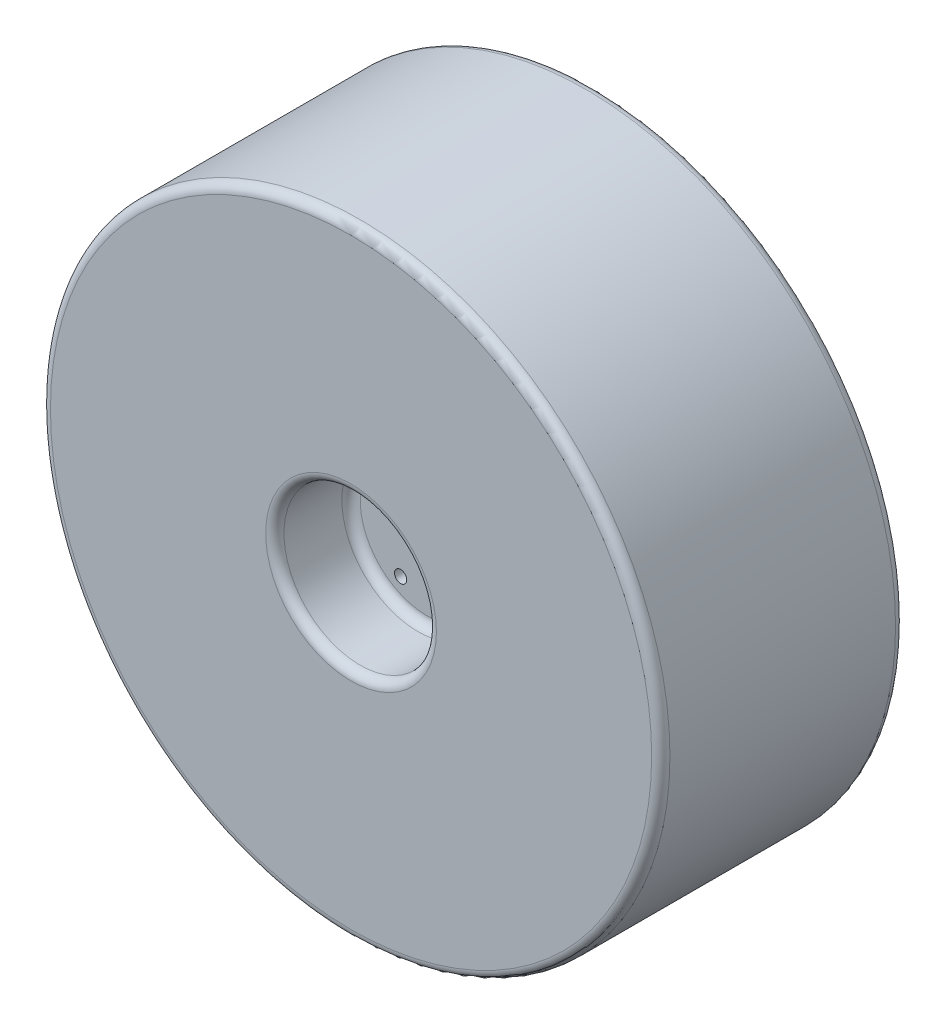
ISO-10303-21;
HEADER;
FILE_DESCRIPTION(('STEP AP214'),'2;1');
FILE_NAME('part.step','',(''),(''),'','','');
FILE_SCHEMA(('AUTOMOTIVE_DESIGN { 1 0 10303 214 1 1 1 1 }'));
ENDSEC;
DATA;
#1=APPLICATION_CONTEXT('core data for automotive mechanical design processes');
#2=APPLICATION_PROTOCOL_DEFINITION('international standard','automotive_design',2000,#1);
#3=PRODUCT_CONTEXT('',#1,'mechanical');
#4=PRODUCT('Part','Part','',(#3));
#5=PRODUCT_RELATED_PRODUCT_CATEGORY('part','',(#4));
#6=PRODUCT_DEFINITION_FORMATION('','',#4);
#7=PRODUCT_DEFINITION_CONTEXT('part definition',#1,'design');
#8=PRODUCT_DEFINITION('design','',#6,#7);
#9=PRODUCT_DEFINITION_SHAPE('','',#8);
#10=(LENGTH_UNIT() NAMED_UNIT(*) SI_UNIT(.MILLI.,.METRE.));
#11=(NAMED_UNIT(*) PLANE_ANGLE_UNIT() SI_UNIT($,.RADIAN.));
#12=(NAMED_UNIT(*) SI_UNIT($,.STERADIAN.) SOLID_ANGLE_UNIT());
#13=UNCERTAINTY_MEASURE_WITH_UNIT(LENGTH_MEASURE(1.E-05),#10,'distance_accuracy_value','');
#14=(GEOMETRIC_REPRESENTATION_CONTEXT(3) GLOBAL_UNCERTAINTY_ASSIGNED_CONTEXT((#13)) GLOBAL_UNIT_ASSIGNED_CONTEXT((#10,
#11,#12)) REPRESENTATION_CONTEXT('',''));
#15=CARTESIAN_POINT('',(0.,0.,0.));
#16=DIRECTION('',(0.,0.,1.));
#17=DIRECTION('',(1.,0.,0.));
#18=AXIS2_PLACEMENT_3D('',#15,#16,#17);
#19=CARTESIAN_POINT('',(0.,0.,160.));
#20=DIRECTION('',(0.,0.,-1.));
#21=DIRECTION('',(-1.,0.,0.));
#22=AXIS2_PLACEMENT_3D('',#19,#20,#21);
#23=CYLINDRICAL_SURFACE('',#22,203.2);
#24=CARTESIAN_POINT('',(0.,0.,6.00000000000001));
#25=DIRECTION('',(0.,0.,1.));
#26=DIRECTION('',(1.,0.,0.));
#27=AXIS2_PLACEMENT_3D('',#24,#25,#26);
#28=CIRCLE('',#27,203.2);
#29=CARTESIAN_POINT('',(203.2,0.,6.00000000000001));
#30=VERTEX_POINT('',#29);
#31=EDGE_CURVE('E39',#30,#30,#28,.T.);
#32=ORIENTED_EDGE('',*,*,#31,.T.);
#33=EDGE_LOOP('',(#32));
#34=FACE_BOUND('',#33,.T.);
#35=CARTESIAN_POINT('',(0.,0.,154.));
#36=DIRECTION('',(0.,0.,1.));
#37=DIRECTION('',(1.,0.,0.));
#38=AXIS2_PLACEMENT_3D('',#35,#36,#37);
#39=CIRCLE('',#38,203.2);
#40=CARTESIAN_POINT('',(203.2,0.,154.));
#41=VERTEX_POINT('',#40);
#42=EDGE_CURVE('E43',#41,#41,#39,.F.);
#43=ORIENTED_EDGE('',*,*,#42,.T.);
#44=EDGE_LOOP('',(#43));
#45=FACE_BOUND('',#44,.T.);
#46=ADVANCED_FACE('F31',(#34,#45),#23,.T.);
#47=CARTESIAN_POINT('',(0.,0.,160.));
#48=DIRECTION('',(0.,0.,1.));
#49=DIRECTION('',(1.,0.,0.));
#50=AXIS2_PLACEMENT_3D('',#47,#48,#49);
#51=PLANE('',#50);
#52=CARTESIAN_POINT('',(0.,0.,160.));
#53=DIRECTION('',(0.,0.,1.));
#54=DIRECTION('',(1.,0.,0.));
#55=AXIS2_PLACEMENT_3D('',#52,#53,#54);
#56=CIRCLE('',#55,56.);
#57=CARTESIAN_POINT('',(56.,0.,160.));
#58=VERTEX_POINT('',#57);
#59=EDGE_CURVE('E63',#58,#58,#56,.F.);
#60=ORIENTED_EDGE('',*,*,#59,.T.);
#61=EDGE_LOOP('',(#60));
#62=FACE_BOUND('',#61,.T.);
#63=CARTESIAN_POINT('',(0.,0.,160.));
#64=DIRECTION('',(0.,0.,1.));
#65=DIRECTION('',(1.,0.,0.));
#66=AXIS2_PLACEMENT_3D('',#63,#64,#65);
#67=CIRCLE('',#66,197.2);
#68=CARTESIAN_POINT('',(197.2,0.,160.));
#69=VERTEX_POINT('',#68);
#70=EDGE_CURVE('E66',#69,#69,#67,.T.);
#71=ORIENTED_EDGE('',*,*,#70,.T.);
#72=EDGE_LOOP('',(#71));
#73=FACE_BOUND('',#72,.T.);
#74=ADVANCED_FACE('F119',(#62,#73),#51,.T.);
#75=CARTESIAN_POINT('',(0.,0.,0.));
#76=DIRECTION('',(0.,0.,1.));
#77=DIRECTION('',(1.,0.,0.));
#78=AXIS2_PLACEMENT_3D('',#75,#76,#77);
#79=PLANE('',#78);
#80=CARTESIAN_POINT('',(0.,0.,0.));
#81=DIRECTION('',(0.,0.,1.));
#82=DIRECTION('',(1.,0.,0.));
#83=AXIS2_PLACEMENT_3D('',#80,#81,#82);
#84=CIRCLE('',#83,56.);
#85=CARTESIAN_POINT('',(56.,0.,0.));
#86=VERTEX_POINT('',#85);
#87=EDGE_CURVE('E48',#86,#86,#84,.T.);
#88=ORIENTED_EDGE('',*,*,#87,.T.);
#89=EDGE_LOOP('',(#88));
#90=FACE_BOUND('',#89,.T.);
#91=CARTESIAN_POINT('',(0.,0.,0.));
#92=DIRECTION('',(0.,0.,1.));
#93=DIRECTION('',(1.,0.,0.));
#94=AXIS2_PLACEMENT_3D('',#91,#92,#93);
#95=CIRCLE('',#94,197.2);
#96=CARTESIAN_POINT('',(197.2,0.,0.));
#97=VERTEX_POINT('',#96);
#98=EDGE_CURVE('E51',#97,#97,#95,.F.);
#99=ORIENTED_EDGE('',*,*,#98,.T.);
#100=EDGE_LOOP('',(#99));
#101=FACE_BOUND('',#100,.T.);
#102=ADVANCED_FACE('F125',(#90,#101),#79,.F.);
#103=CARTESIAN_POINT('',(0.,0.,110.));
#104=DIRECTION('',(0.,0.,1.));
#105=DIRECTION('',(1.,0.,0.));
#106=AXIS2_PLACEMENT_3D('',#103,#104,#105);
#107=CYLINDRICAL_SURFACE('',#106,50.);
#108=CARTESIAN_POINT('',(0.,0.,154.));
#109=DIRECTION('',(0.,0.,1.));
#110=DIRECTION('',(1.,0.,0.));
#111=AXIS2_PLACEMENT_3D('',#108,#109,#110);
#112=CIRCLE('',#111,50.);
#113=CARTESIAN_POINT('',(50.,0.,154.));
#114=VERTEX_POINT('',#113);
#115=EDGE_CURVE('E69',#114,#114,#112,.T.);
#116=ORIENTED_EDGE('',*,*,#115,.T.);
#117=EDGE_LOOP('',(#116));
#118=FACE_BOUND('',#117,.T.);
#119=CARTESIAN_POINT('',(0.,0.,116.));
#120=DIRECTION('',(0.,0.,1.));
#121=DIRECTION('',(1.,0.,0.));
#122=AXIS2_PLACEMENT_3D('',#119,#120,#121);
#123=CIRCLE('',#122,50.);
#124=CARTESIAN_POINT('',(50.,0.,116.));
#125=VERTEX_POINT('',#124);
#126=EDGE_CURVE('E72',#125,#125,#123,.F.);
#127=ORIENTED_EDGE('',*,*,#126,.T.);
#128=EDGE_LOOP('',(#127));
#129=FACE_BOUND('',#128,.T.);
#130=ADVANCED_FACE('F259',(#118,#129),#107,.F.);
#131=CARTESIAN_POINT('',(0.,0.,110.));
#132=DIRECTION('',(0.,0.,1.));
#133=DIRECTION('',(1.,0.,0.));
#134=AXIS2_PLACEMENT_3D('',#131,#132,#133);
#135=PLANE('',#134);
#136=CARTESIAN_POINT('',(0.,0.,110.));
#137=DIRECTION('',(0.,0.,1.));
#138=DIRECTION('',(1.,0.,0.));
#139=AXIS2_PLACEMENT_3D('',#136,#137,#138);
#140=CIRCLE('',#139,6.5);
#141=CARTESIAN_POINT('',(6.5,0.,110.));
#142=VERTEX_POINT('',#141);
#143=EDGE_CURVE('E93',#142,#142,#140,.T.);
#144=ORIENTED_EDGE('',*,*,#143,.F.);
#145=EDGE_LOOP('',(#144));
#146=FACE_BOUND('',#145,.T.);
#147=CARTESIAN_POINT('',(-17.4999999999997,30.3108891324555,110.));
#148=DIRECTION('',(0.,0.,1.));
#149=DIRECTION('',(1.,0.,0.));
#150=AXIS2_PLACEMENT_3D('',#147,#148,#149);
#151=CIRCLE('',#150,4.00000000000001);
#152=CARTESIAN_POINT('',(-13.4999999999997,30.3108891324555,110.));
#153=VERTEX_POINT('',#152);
#154=EDGE_CURVE('E88',#153,#153,#151,.T.);
#155=ORIENTED_EDGE('',*,*,#154,.F.);
#156=EDGE_LOOP('',(#155));
#157=FACE_BOUND('',#156,.T.);
#158=CARTESIAN_POINT('',(-17.5000000000001,-30.3108891324553,110.));
#159=DIRECTION('',(0.,0.,1.));
#160=DIRECTION('',(1.,0.,0.));
#161=AXIS2_PLACEMENT_3D('',#158,#159,#160);
#162=CIRCLE('',#161,4.00000000000001);
#163=CARTESIAN_POINT('',(-13.5000000000001,-30.3108891324553,110.));
#164=VERTEX_POINT('',#163);
#165=EDGE_CURVE('E82',#164,#164,#162,.T.);
#166=ORIENTED_EDGE('',*,*,#165,.F.);
#167=EDGE_LOOP('',(#166));
#168=FACE_BOUND('',#167,.T.);
#169=CARTESIAN_POINT('',(35.,0.,110.));
#170=DIRECTION('',(0.,0.,1.));
#171=DIRECTION('',(1.,0.,0.));
#172=AXIS2_PLACEMENT_3D('',#169,#170,#171);
#173=CIRCLE('',#172,4.00000000000001);
#174=CARTESIAN_POINT('',(39.,0.,110.));
#175=VERTEX_POINT('',#174);
#176=EDGE_CURVE('E76',#175,#175,#173,.T.);
#177=ORIENTED_EDGE('',*,*,#176,.F.);
#178=EDGE_LOOP('',(#177));
#179=FACE_BOUND('',#178,.T.);
#180=CARTESIAN_POINT('',(0.,0.,110.));
#181=DIRECTION('',(0.,0.,1.));
#182=DIRECTION('',(1.,0.,0.));
#183=AXIS2_PLACEMENT_3D('',#180,#181,#182);
#184=CIRCLE('',#183,44.);
#185=CARTESIAN_POINT('',(44.,0.,110.));
#186=VERTEX_POINT('',#185);
#187=EDGE_CURVE('E60',#186,#186,#184,.T.);
#188=ORIENTED_EDGE('',*,*,#187,.T.);
#189=EDGE_LOOP('',(#188));
#190=FACE_BOUND('',#189,.T.);
#191=ADVANCED_FACE('F114',(#146,#157,#168,#179,#190),#135,.T.);
#192=CARTESIAN_POINT('',(0.,0.,50.));
#193=DIRECTION('',(0.,0.,-1.));
#194=DIRECTION('',(-1.,0.,0.));
#195=AXIS2_PLACEMENT_3D('',#192,#193,#194);
#196=CYLINDRICAL_SURFACE('',#195,50.);
#197=CARTESIAN_POINT('',(0.,0.,6.));
#198=DIRECTION('',(0.,0.,1.));
#199=DIRECTION('',(1.,0.,0.));
#200=AXIS2_PLACEMENT_3D('',#197,#198,#199);
#201=CIRCLE('',#200,50.);
#202=CARTESIAN_POINT('',(50.,0.,6.));
#203=VERTEX_POINT('',#202);
#204=EDGE_CURVE('E54',#203,#203,#201,.F.);
#205=ORIENTED_EDGE('',*,*,#204,.T.);
#206=EDGE_LOOP('',(#205));
#207=FACE_BOUND('',#206,.T.);
#208=CARTESIAN_POINT('',(0.,0.,44.));
#209=DIRECTION('',(0.,0.,-1.));
#210=DIRECTION('',(-1.,0.,0.));
#211=AXIS2_PLACEMENT_3D('',#208,#209,#210);
#212=CIRCLE('',#211,50.);
#213=CARTESIAN_POINT('',(-50.,0.,44.));
#214=VERTEX_POINT('',#213);
#215=EDGE_CURVE('E57',#214,#214,#212,.F.);
#216=ORIENTED_EDGE('',*,*,#215,.T.);
#217=EDGE_LOOP('',(#216));
#218=FACE_BOUND('',#217,.T.);
#219=ADVANCED_FACE('F105',(#207,#218),#196,.F.);
#220=CARTESIAN_POINT('',(0.,0.,50.));
#221=DIRECTION('',(0.,0.,-1.));
#222=DIRECTION('',(-1.,0.,0.));
#223=AXIS2_PLACEMENT_3D('',#220,#221,#222);
#224=PLANE('',#223);
#225=CARTESIAN_POINT('',(0.,0.,50.));
#226=DIRECTION('',(0.,0.,-1.));
#227=DIRECTION('',(-1.,0.,0.));
#228=AXIS2_PLACEMENT_3D('',#225,#226,#227);
#229=CIRCLE('',#228,6.5);
#230=CARTESIAN_POINT('',(-6.5,0.,50.));
#231=VERTEX_POINT('',#230);
#232=EDGE_CURVE('E35',#231,#231,#229,.T.);
#233=ORIENTED_EDGE('',*,*,#232,.F.);
#234=EDGE_LOOP('',(#233));
#235=FACE_BOUND('',#234,.T.);
#236=CARTESIAN_POINT('',(0.,0.,50.));
#237=DIRECTION('',(0.,0.,-1.));
#238=DIRECTION('',(-1.,0.,0.));
#239=AXIS2_PLACEMENT_3D('',#236,#237,#238);
#240=CIRCLE('',#239,44.);
#241=CARTESIAN_POINT('',(-44.,0.,50.));
#242=VERTEX_POINT('',#241);
#243=EDGE_CURVE('E10',#242,#242,#240,.T.);
#244=ORIENTED_EDGE('',*,*,#243,.T.);
#245=EDGE_LOOP('',(#244));
#246=FACE_BOUND('',#245,.T.);
#247=ADVANCED_FACE('F102',(#235,#246),#224,.T.);
#248=CARTESIAN_POINT('',(0.,0.,154.));
#249=DIRECTION('',(0.,0.,1.));
#250=DIRECTION('',(1.,0.,0.));
#251=AXIS2_PLACEMENT_3D('',#248,#249,#250);
#252=TOROIDAL_SURFACE('',#251,56.,6.);
#253=ORIENTED_EDGE('',*,*,#59,.F.);
#254=EDGE_LOOP('',(#253));
#255=FACE_BOUND('',#254,.T.);
#256=ORIENTED_EDGE('',*,*,#115,.F.);
#257=EDGE_LOOP('',(#256));
#258=FACE_BOUND('',#257,.T.);
#259=ADVANCED_FACE('F104',(#255,#258),#252,.T.);
#260=CARTESIAN_POINT('',(0.,0.,116.));
#261=DIRECTION('',(0.,0.,1.));
#262=DIRECTION('',(1.,0.,0.));
#263=AXIS2_PLACEMENT_3D('',#260,#261,#262);
#264=TOROIDAL_SURFACE('',#263,44.,6.);
#265=ORIENTED_EDGE('',*,*,#126,.F.);
#266=EDGE_LOOP('',(#265));
#267=FACE_BOUND('',#266,.T.);
#268=ORIENTED_EDGE('',*,*,#187,.F.);
#269=EDGE_LOOP('',(#268));
#270=FACE_BOUND('',#269,.T.);
#271=ADVANCED_FACE('F111',(#267,#270),#264,.F.);
#272=CARTESIAN_POINT('',(0.,0.,6.));
#273=DIRECTION('',(0.,0.,1.));
#274=DIRECTION('',(1.,0.,0.));
#275=AXIS2_PLACEMENT_3D('',#272,#273,#274);
#276=TOROIDAL_SURFACE('',#275,56.,6.);
#277=ORIENTED_EDGE('',*,*,#87,.F.);
#278=EDGE_LOOP('',(#277));
#279=FACE_BOUND('',#278,.T.);
#280=ORIENTED_EDGE('',*,*,#204,.F.);
#281=EDGE_LOOP('',(#280));
#282=FACE_BOUND('',#281,.T.);
#283=ADVANCED_FACE('F133',(#279,#282),#276,.T.);
#284=CARTESIAN_POINT('',(0.,0.,6.00000000000001));
#285=DIRECTION('',(0.,0.,1.));
#286=DIRECTION('',(1.,0.,0.));
#287=AXIS2_PLACEMENT_3D('',#284,#285,#286);
#288=TOROIDAL_SURFACE('',#287,197.2,6.);
#289=ORIENTED_EDGE('',*,*,#98,.F.);
#290=EDGE_LOOP('',(#289));
#291=FACE_BOUND('',#290,.T.);
#292=ORIENTED_EDGE('',*,*,#31,.F.);
#293=EDGE_LOOP('',(#292));
#294=FACE_BOUND('',#293,.T.);
#295=ADVANCED_FACE('F137',(#291,#294),#288,.T.);
#296=CARTESIAN_POINT('',(0.,0.,154.));
#297=DIRECTION('',(0.,0.,1.));
#298=DIRECTION('',(1.,0.,0.));
#299=AXIS2_PLACEMENT_3D('',#296,#297,#298);
#300=TOROIDAL_SURFACE('',#299,197.2,6.);
#301=ORIENTED_EDGE('',*,*,#42,.F.);
#302=EDGE_LOOP('',(#301));
#303=FACE_BOUND('',#302,.T.);
#304=ORIENTED_EDGE('',*,*,#70,.F.);
#305=EDGE_LOOP('',(#304));
#306=FACE_BOUND('',#305,.T.);
#307=ADVANCED_FACE('F140',(#303,#306),#300,.T.);
#308=CARTESIAN_POINT('',(0.,0.,44.));
#309=DIRECTION('',(0.,0.,-1.));
#310=DIRECTION('',(-1.,0.,0.));
#311=AXIS2_PLACEMENT_3D('',#308,#309,#310);
#312=TOROIDAL_SURFACE('',#311,44.,6.);
#313=ORIENTED_EDGE('',*,*,#215,.F.);
#314=EDGE_LOOP('',(#313));
#315=FACE_BOUND('',#314,.T.);
#316=ORIENTED_EDGE('',*,*,#243,.F.);
#317=EDGE_LOOP('',(#316));
#318=FACE_BOUND('',#317,.T.);
#319=ADVANCED_FACE('F33',(#315,#318),#312,.F.);
#320=CARTESIAN_POINT('',(35.,0.,65.));
#321=DIRECTION('',(0.,0.,1.));
#322=DIRECTION('',(1.,0.,0.));
#323=AXIS2_PLACEMENT_3D('',#320,#321,#322);
#324=CYLINDRICAL_SURFACE('',#323,4.00000000000001);
#325=CARTESIAN_POINT('',(35.,0.,65.));
#326=DIRECTION('',(0.,0.,1.));
#327=DIRECTION('',(1.,0.,0.));
#328=AXIS2_PLACEMENT_3D('',#325,#326,#327);
#329=CIRCLE('',#328,4.00000000000001);
#330=CARTESIAN_POINT('',(39.,0.,65.));
#331=VERTEX_POINT('',#330);
#332=EDGE_CURVE('E75',#331,#331,#329,.T.);
#333=ORIENTED_EDGE('',*,*,#332,.F.);
#334=EDGE_LOOP('',(#333));
#335=FACE_BOUND('',#334,.T.);
#336=ORIENTED_EDGE('',*,*,#176,.T.);
#337=EDGE_LOOP('',(#336));
#338=FACE_BOUND('',#337,.T.);
#339=ADVANCED_FACE('F147',(#335,#338),#324,.F.);
#340=CARTESIAN_POINT('',(35.,0.,65.));
#341=DIRECTION('',(0.,0.,1.));
#342=DIRECTION('',(1.,0.,0.));
#343=AXIS2_PLACEMENT_3D('',#340,#341,#342);
#344=PLANE('',#343);
#345=ORIENTED_EDGE('',*,*,#332,.T.);
#346=EDGE_LOOP('',(#345));
#347=FACE_BOUND('',#346,.T.);
#348=ADVANCED_FACE('F156',(#347),#344,.T.);
#349=CARTESIAN_POINT('',(-17.5000000000001,-30.3108891324553,65.));
#350=DIRECTION('',(0.,0.,1.));
#351=DIRECTION('',(1.,0.,0.));
#352=AXIS2_PLACEMENT_3D('',#349,#350,#351);
#353=CYLINDRICAL_SURFACE('',#352,4.00000000000001);
#354=CARTESIAN_POINT('',(-17.5000000000001,-30.3108891324553,65.));
#355=DIRECTION('',(0.,0.,1.));
#356=DIRECTION('',(1.,0.,0.));
#357=AXIS2_PLACEMENT_3D('',#354,#355,#356);
#358=CIRCLE('',#357,4.00000000000001);
#359=CARTESIAN_POINT('',(-13.5000000000001,-30.3108891324553,65.));
#360=VERTEX_POINT('',#359);
#361=EDGE_CURVE('E79',#360,#360,#358,.T.);
#362=ORIENTED_EDGE('',*,*,#361,.F.);
#363=EDGE_LOOP('',(#362));
#364=FACE_BOUND('',#363,.T.);
#365=ORIENTED_EDGE('',*,*,#165,.T.);
#366=EDGE_LOOP('',(#365));
#367=FACE_BOUND('',#366,.T.);
#368=ADVANCED_FACE('F164',(#364,#367),#353,.F.);
#369=CARTESIAN_POINT('',(-17.5000000000001,-30.3108891324553,65.));
#370=DIRECTION('',(0.,0.,1.));
#371=DIRECTION('',(1.,0.,0.));
#372=AXIS2_PLACEMENT_3D('',#369,#370,#371);
#373=PLANE('',#372);
#374=ORIENTED_EDGE('',*,*,#361,.T.);
#375=EDGE_LOOP('',(#374));
#376=FACE_BOUND('',#375,.T.);
#377=ADVANCED_FACE('F172',(#376),#373,.T.);
#378=CARTESIAN_POINT('',(-17.4999999999997,30.3108891324555,65.));
#379=DIRECTION('',(0.,0.,1.));
#380=DIRECTION('',(1.,0.,0.));
#381=AXIS2_PLACEMENT_3D('',#378,#379,#380);
#382=CYLINDRICAL_SURFACE('',#381,4.00000000000001);
#383=CARTESIAN_POINT('',(-17.4999999999997,30.3108891324555,65.));
#384=DIRECTION('',(0.,0.,1.));
#385=DIRECTION('',(1.,0.,0.));
#386=AXIS2_PLACEMENT_3D('',#383,#384,#385);
#387=CIRCLE('',#386,4.00000000000001);
#388=CARTESIAN_POINT('',(-13.4999999999997,30.3108891324555,65.));
#389=VERTEX_POINT('',#388);
#390=EDGE_CURVE('E85',#389,#389,#387,.T.);
#391=ORIENTED_EDGE('',*,*,#390,.F.);
#392=EDGE_LOOP('',(#391));
#393=FACE_BOUND('',#392,.T.);
#394=ORIENTED_EDGE('',*,*,#154,.T.);
#395=EDGE_LOOP('',(#394));
#396=FACE_BOUND('',#395,.T.);
#397=ADVANCED_FACE('F176',(#393,#396),#382,.F.);
#398=CARTESIAN_POINT('',(-17.4999999999997,30.3108891324555,65.));
#399=DIRECTION('',(0.,0.,1.));
#400=DIRECTION('',(1.,0.,0.));
#401=AXIS2_PLACEMENT_3D('',#398,#399,#400);
#402=PLANE('',#401);
#403=ORIENTED_EDGE('',*,*,#390,.T.);
#404=EDGE_LOOP('',(#403));
#405=FACE_BOUND('',#404,.T.);
#406=ADVANCED_FACE('F180',(#405),#402,.T.);
#407=CARTESIAN_POINT('',(0.,0.,0.));
#408=DIRECTION('',(0.,0.,1.));
#409=DIRECTION('',(1.,0.,0.));
#410=AXIS2_PLACEMENT_3D('',#407,#408,#409);
#411=CYLINDRICAL_SURFACE('',#410,6.5);
#412=ORIENTED_EDGE('',*,*,#232,.T.);
#413=EDGE_LOOP('',(#412));
#414=FACE_BOUND('',#413,.T.);
#415=ORIENTED_EDGE('',*,*,#143,.T.);
#416=EDGE_LOOP('',(#415));
#417=FACE_BOUND('',#416,.T.);
#418=ADVANCED_FACE('F100',(#414,#417),#411,.F.);
#419=CLOSED_SHELL('',(#46,#74,#102,#130,#191,#219,#247,#259,#271,#283,#295,#307,#319,#339,#348,
#368,#377,#397,#406,#418));
#420=MANIFOLD_SOLID_BREP('B2',#419);
#421=ADVANCED_BREP_SHAPE_REPRESENTATION('',(#18,#420),#14);
#422=SHAPE_DEFINITION_REPRESENTATION(#9,#421);
ENDSEC;
END-ISO-10303-21;
